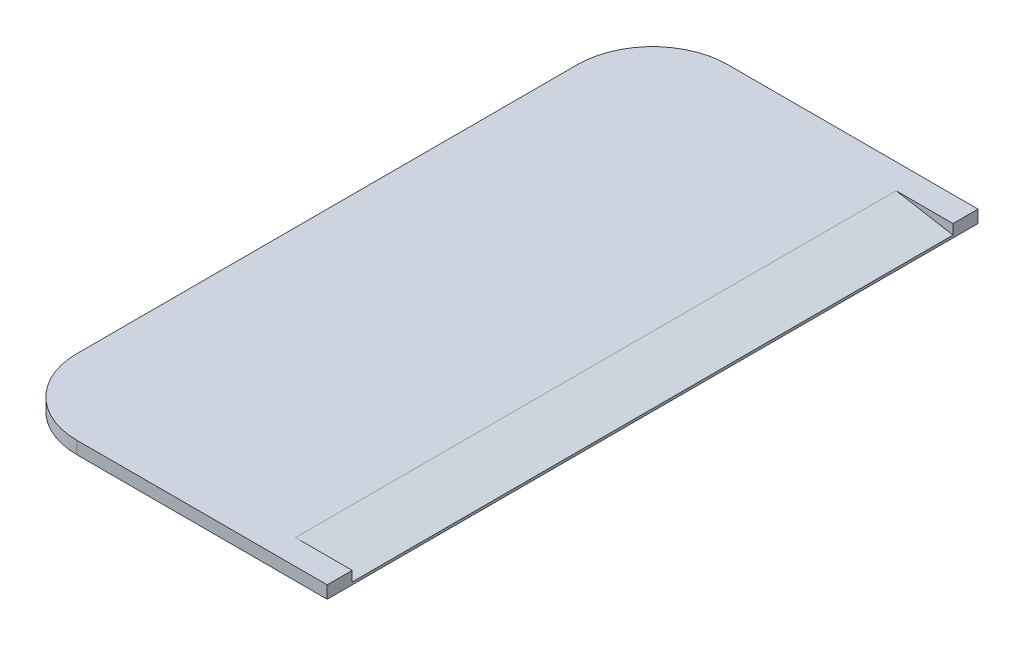
ISO-10303-21;
HEADER;
FILE_DESCRIPTION(('STEP AP214'),'2;1');
FILE_NAME('part.step','',(''),(''),'','','');
FILE_SCHEMA(('AUTOMOTIVE_DESIGN { 1 0 10303 214 1 1 1 1 }'));
ENDSEC;
DATA;
#1=APPLICATION_CONTEXT('core data for automotive mechanical design processes');
#2=APPLICATION_PROTOCOL_DEFINITION('international standard','automotive_design',2000,#1);
#3=PRODUCT_CONTEXT('',#1,'mechanical');
#4=PRODUCT('Part','Part','',(#3));
#5=PRODUCT_RELATED_PRODUCT_CATEGORY('part','',(#4));
#6=PRODUCT_DEFINITION_FORMATION('','',#4);
#7=PRODUCT_DEFINITION_CONTEXT('part definition',#1,'design');
#8=PRODUCT_DEFINITION('design','',#6,#7);
#9=PRODUCT_DEFINITION_SHAPE('','',#8);
#10=(LENGTH_UNIT() NAMED_UNIT(*) SI_UNIT(.MILLI.,.METRE.));
#11=(NAMED_UNIT(*) PLANE_ANGLE_UNIT() SI_UNIT($,.RADIAN.));
#12=(NAMED_UNIT(*) SI_UNIT($,.STERADIAN.) SOLID_ANGLE_UNIT());
#13=UNCERTAINTY_MEASURE_WITH_UNIT(LENGTH_MEASURE(1.E-05),#10,'distance_accuracy_value','');
#14=(GEOMETRIC_REPRESENTATION_CONTEXT(3) GLOBAL_UNCERTAINTY_ASSIGNED_CONTEXT((#13)) GLOBAL_UNIT_ASSIGNED_CONTEXT((#10,
#11,#12)) REPRESENTATION_CONTEXT('',''));
#15=CARTESIAN_POINT('',(0.,0.,0.));
#16=DIRECTION('',(0.,0.,1.));
#17=DIRECTION('',(1.,0.,0.));
#18=AXIS2_PLACEMENT_3D('',#15,#16,#17);
#19=CARTESIAN_POINT('',(13.,0.5,26.));
#20=DIRECTION('',(-1.,0.,0.));
#21=DIRECTION('',(0.,0.,1.));
#22=AXIS2_PLACEMENT_3D('',#19,#20,#21);
#23=PLANE('',#22);
#24=DIRECTION('',(0.,1.,0.));
#25=VECTOR('',#24,1.);
#26=CARTESIAN_POINT('',(13.,0.5,-24.));
#27=LINE('',#26,#25);
#28=CARTESIAN_POINT('',(13.,-0.3,-24.));
#29=VERTEX_POINT('',#28);
#30=CARTESIAN_POINT('',(13.,0.5,-24.));
#31=VERTEX_POINT('',#30);
#32=EDGE_CURVE('E172',#29,#31,#27,.T.);
#33=ORIENTED_EDGE('',*,*,#32,.F.);
#34=DIRECTION('',(0.,0.,1.));
#35=VECTOR('',#34,1.);
#36=CARTESIAN_POINT('',(13.,-0.3,-24.));
#37=LINE('',#36,#35);
#38=CARTESIAN_POINT('',(13.,-0.3,24.));
#39=VERTEX_POINT('',#38);
#40=EDGE_CURVE('E134',#29,#39,#37,.T.);
#41=ORIENTED_EDGE('',*,*,#40,.T.);
#42=DIRECTION('',(0.,1.,0.));
#43=VECTOR('',#42,1.);
#44=CARTESIAN_POINT('',(13.,0.5,24.));
#45=LINE('',#44,#43);
#46=CARTESIAN_POINT('',(13.,0.5,24.));
#47=VERTEX_POINT('',#46);
#48=EDGE_CURVE('E161',#39,#47,#45,.T.);
#49=ORIENTED_EDGE('',*,*,#48,.T.);
#50=DIRECTION('',(0.,0.,-1.));
#51=VECTOR('',#50,1.);
#52=CARTESIAN_POINT('',(13.,0.5,26.));
#53=LINE('',#52,#51);
#54=CARTESIAN_POINT('',(13.,0.5,26.));
#55=VERTEX_POINT('',#54);
#56=EDGE_CURVE('E157',#55,#47,#53,.T.);
#57=ORIENTED_EDGE('',*,*,#56,.F.);
#58=DIRECTION('',(0.,-1.,0.));
#59=VECTOR('',#58,1.);
#60=CARTESIAN_POINT('',(13.,0.5,26.));
#61=LINE('',#60,#59);
#62=CARTESIAN_POINT('',(13.,-0.5,26.));
#63=VERTEX_POINT('',#62);
#64=EDGE_CURVE('E126',#55,#63,#61,.T.);
#65=ORIENTED_EDGE('',*,*,#64,.T.);
#66=DIRECTION('',(0.,0.,-1.));
#67=VECTOR('',#66,1.);
#68=CARTESIAN_POINT('',(13.,-0.5,26.));
#69=LINE('',#68,#67);
#70=CARTESIAN_POINT('',(13.,-0.5,-26.));
#71=VERTEX_POINT('',#70);
#72=EDGE_CURVE('E130',#63,#71,#69,.T.);
#73=ORIENTED_EDGE('',*,*,#72,.T.);
#74=DIRECTION('',(0.,-1.,0.));
#75=VECTOR('',#74,1.);
#76=CARTESIAN_POINT('',(13.,0.5,-26.));
#77=LINE('',#76,#75);
#78=CARTESIAN_POINT('',(13.,0.5,-26.));
#79=VERTEX_POINT('',#78);
#80=EDGE_CURVE('E11',#79,#71,#77,.T.);
#81=ORIENTED_EDGE('',*,*,#80,.F.);
#82=EDGE_CURVE('E91',#31,#79,#53,.T.);
#83=ORIENTED_EDGE('',*,*,#82,.F.);
#84=EDGE_LOOP('',(#33,#41,#49,#57,#65,#73,#81,#83));
#85=FACE_BOUND('',#84,.T.);
#86=ADVANCED_FACE('F33',(#85),#23,.F.);
#87=CARTESIAN_POINT('',(-7.,0.5,-20.));
#88=DIRECTION('',(0.,-1.,0.));
#89=DIRECTION('',(0.,0.,-1.));
#90=AXIS2_PLACEMENT_3D('',#87,#88,#89);
#91=PLANE('',#90);
#92=DIRECTION('',(-1.,0.,0.));
#93=VECTOR('',#92,1.);
#94=CARTESIAN_POINT('',(8.46297454430565,0.5,-24.));
#95=LINE('',#94,#93);
#96=CARTESIAN_POINT('',(8.46297454430565,0.5,-24.));
#97=VERTEX_POINT('',#96);
#98=EDGE_CURVE('E178',#31,#97,#95,.T.);
#99=ORIENTED_EDGE('',*,*,#98,.F.);
#100=ORIENTED_EDGE('',*,*,#82,.T.);
#101=DIRECTION('',(-1.,0.,0.));
#102=VECTOR('',#101,1.);
#103=CARTESIAN_POINT('',(-7.,0.5,-26.));
#104=LINE('',#103,#102);
#105=CARTESIAN_POINT('',(-7.,0.5,-26.));
#106=VERTEX_POINT('',#105);
#107=EDGE_CURVE('E163',#79,#106,#104,.T.);
#108=ORIENTED_EDGE('',*,*,#107,.T.);
#109=CARTESIAN_POINT('',(-7.,0.5,-20.));
#110=DIRECTION('',(0.,1.,0.));
#111=DIRECTION('',(0.,0.,-1.));
#112=AXIS2_PLACEMENT_3D('',#109,#110,#111);
#113=CIRCLE('',#112,6.);
#114=CARTESIAN_POINT('',(-13.,0.5,-20.));
#115=VERTEX_POINT('',#114);
#116=EDGE_CURVE('E109',#106,#115,#113,.T.);
#117=ORIENTED_EDGE('',*,*,#116,.T.);
#118=DIRECTION('',(0.,0.,1.));
#119=VECTOR('',#118,1.);
#120=CARTESIAN_POINT('',(-13.,0.5,20.));
#121=LINE('',#120,#119);
#122=CARTESIAN_POINT('',(-13.,0.5,20.));
#123=VERTEX_POINT('',#122);
#124=EDGE_CURVE('E102',#115,#123,#121,.T.);
#125=ORIENTED_EDGE('',*,*,#124,.T.);
#126=CARTESIAN_POINT('',(-7.,0.5,20.));
#127=DIRECTION('',(0.,1.,0.));
#128=DIRECTION('',(0.,0.,-1.));
#129=AXIS2_PLACEMENT_3D('',#126,#127,#128);
#130=CIRCLE('',#129,6.);
#131=CARTESIAN_POINT('',(-7.,0.5,26.));
#132=VERTEX_POINT('',#131);
#133=EDGE_CURVE('E106',#123,#132,#130,.T.);
#134=ORIENTED_EDGE('',*,*,#133,.T.);
#135=DIRECTION('',(1.,0.,0.));
#136=VECTOR('',#135,1.);
#137=CARTESIAN_POINT('',(-7.,0.5,26.));
#138=LINE('',#137,#136);
#139=EDGE_CURVE('E56',#132,#55,#138,.T.);
#140=ORIENTED_EDGE('',*,*,#139,.T.);
#141=ORIENTED_EDGE('',*,*,#56,.T.);
#142=DIRECTION('',(-1.,0.,0.));
#143=VECTOR('',#142,1.);
#144=CARTESIAN_POINT('',(8.46297454430565,0.5,24.));
#145=LINE('',#144,#143);
#146=CARTESIAN_POINT('',(8.46297454430565,0.5,24.));
#147=VERTEX_POINT('',#146);
#148=EDGE_CURVE('E173',#47,#147,#145,.T.);
#149=ORIENTED_EDGE('',*,*,#148,.T.);
#150=DIRECTION('',(0.,0.,1.));
#151=VECTOR('',#150,1.);
#152=CARTESIAN_POINT('',(8.46297454430565,0.5,-24.));
#153=LINE('',#152,#151);
#154=EDGE_CURVE('E167',#97,#147,#153,.T.);
#155=ORIENTED_EDGE('',*,*,#154,.F.);
#156=EDGE_LOOP('',(#99,#100,#108,#117,#125,#134,#140,#141,#149,#155));
#157=FACE_BOUND('',#156,.T.);
#158=ADVANCED_FACE('F104',(#157),#91,.F.);
#159=CARTESIAN_POINT('',(-7.,0.5,-26.));
#160=DIRECTION('',(0.,0.,1.));
#161=DIRECTION('',(1.,0.,0.));
#162=AXIS2_PLACEMENT_3D('',#159,#160,#161);
#163=PLANE('',#162);
#164=DIRECTION('',(-1.,0.,0.));
#165=VECTOR('',#164,1.);
#166=CARTESIAN_POINT('',(-7.,-0.5,-26.));
#167=LINE('',#166,#165);
#168=CARTESIAN_POINT('',(-7.,-0.5,-26.));
#169=VERTEX_POINT('',#168);
#170=EDGE_CURVE('E133',#71,#169,#167,.T.);
#171=ORIENTED_EDGE('',*,*,#170,.T.);
#172=DIRECTION('',(0.,-1.,0.));
#173=VECTOR('',#172,1.);
#174=CARTESIAN_POINT('',(-7.,0.5,-26.));
#175=LINE('',#174,#173);
#176=EDGE_CURVE('E40',#106,#169,#175,.T.);
#177=ORIENTED_EDGE('',*,*,#176,.F.);
#178=ORIENTED_EDGE('',*,*,#107,.F.);
#179=ORIENTED_EDGE('',*,*,#80,.T.);
#180=EDGE_LOOP('',(#171,#177,#178,#179));
#181=FACE_BOUND('',#180,.T.);
#182=ADVANCED_FACE('F190',(#181),#163,.F.);
#183=CARTESIAN_POINT('',(-7.,0.5,-20.));
#184=DIRECTION('',(0.,-1.,0.));
#185=DIRECTION('',(0.,0.,-1.));
#186=AXIS2_PLACEMENT_3D('',#183,#184,#185);
#187=CYLINDRICAL_SURFACE('',#186,6.);
#188=CARTESIAN_POINT('',(-7.,-0.5,-20.));
#189=DIRECTION('',(0.,1.,0.));
#190=DIRECTION('',(0.,0.,-1.));
#191=AXIS2_PLACEMENT_3D('',#188,#189,#190);
#192=CIRCLE('',#191,6.);
#193=CARTESIAN_POINT('',(-13.,-0.5,-20.));
#194=VERTEX_POINT('',#193);
#195=EDGE_CURVE('E136',#169,#194,#192,.T.);
#196=ORIENTED_EDGE('',*,*,#195,.T.);
#197=DIRECTION('',(0.,-1.,0.));
#198=VECTOR('',#197,1.);
#199=CARTESIAN_POINT('',(-13.,0.5,-20.));
#200=LINE('',#199,#198);
#201=EDGE_CURVE('E121',#115,#194,#200,.T.);
#202=ORIENTED_EDGE('',*,*,#201,.F.);
#203=ORIENTED_EDGE('',*,*,#116,.F.);
#204=ORIENTED_EDGE('',*,*,#176,.T.);
#205=EDGE_LOOP('',(#196,#202,#203,#204));
#206=FACE_BOUND('',#205,.T.);
#207=ADVANCED_FACE('F148',(#206),#187,.T.);
#208=CARTESIAN_POINT('',(-13.,0.5,20.));
#209=DIRECTION('',(1.,0.,0.));
#210=DIRECTION('',(0.,0.,-1.));
#211=AXIS2_PLACEMENT_3D('',#208,#209,#210);
#212=PLANE('',#211);
#213=DIRECTION('',(0.,0.,1.));
#214=VECTOR('',#213,1.);
#215=CARTESIAN_POINT('',(-13.,-0.5,20.));
#216=LINE('',#215,#214);
#217=CARTESIAN_POINT('',(-13.,-0.5,20.));
#218=VERTEX_POINT('',#217);
#219=EDGE_CURVE('E118',#194,#218,#216,.T.);
#220=ORIENTED_EDGE('',*,*,#219,.T.);
#221=DIRECTION('',(0.,-1.,0.));
#222=VECTOR('',#221,1.);
#223=CARTESIAN_POINT('',(-13.,0.5,20.));
#224=LINE('',#223,#222);
#225=EDGE_CURVE('E115',#123,#218,#224,.T.);
#226=ORIENTED_EDGE('',*,*,#225,.F.);
#227=ORIENTED_EDGE('',*,*,#124,.F.);
#228=ORIENTED_EDGE('',*,*,#201,.T.);
#229=EDGE_LOOP('',(#220,#226,#227,#228));
#230=FACE_BOUND('',#229,.T.);
#231=ADVANCED_FACE('F116',(#230),#212,.F.);
#232=CARTESIAN_POINT('',(-7.,0.5,20.));
#233=DIRECTION('',(0.,-1.,0.));
#234=DIRECTION('',(0.,0.,-1.));
#235=AXIS2_PLACEMENT_3D('',#232,#233,#234);
#236=CYLINDRICAL_SURFACE('',#235,6.);
#237=CARTESIAN_POINT('',(-7.,-0.5,20.));
#238=DIRECTION('',(0.,1.,0.));
#239=DIRECTION('',(0.,0.,-1.));
#240=AXIS2_PLACEMENT_3D('',#237,#238,#239);
#241=CIRCLE('',#240,6.);
#242=CARTESIAN_POINT('',(-7.,-0.5,26.));
#243=VERTEX_POINT('',#242);
#244=EDGE_CURVE('E139',#218,#243,#241,.T.);
#245=ORIENTED_EDGE('',*,*,#244,.T.);
#246=DIRECTION('',(0.,-1.,0.));
#247=VECTOR('',#246,1.);
#248=CARTESIAN_POINT('',(-7.,0.5,26.));
#249=LINE('',#248,#247);
#250=EDGE_CURVE('E122',#132,#243,#249,.T.);
#251=ORIENTED_EDGE('',*,*,#250,.F.);
#252=ORIENTED_EDGE('',*,*,#133,.F.);
#253=ORIENTED_EDGE('',*,*,#225,.T.);
#254=EDGE_LOOP('',(#245,#251,#252,#253));
#255=FACE_BOUND('',#254,.T.);
#256=ADVANCED_FACE('F124',(#255),#236,.T.);
#257=CARTESIAN_POINT('',(-7.,0.5,26.));
#258=DIRECTION('',(0.,0.,-1.));
#259=DIRECTION('',(-1.,0.,0.));
#260=AXIS2_PLACEMENT_3D('',#257,#258,#259);
#261=PLANE('',#260);
#262=DIRECTION('',(1.,0.,0.));
#263=VECTOR('',#262,1.);
#264=CARTESIAN_POINT('',(-7.,-0.5,26.));
#265=LINE('',#264,#263);
#266=EDGE_CURVE('E83',#243,#63,#265,.T.);
#267=ORIENTED_EDGE('',*,*,#266,.T.);
#268=ORIENTED_EDGE('',*,*,#64,.F.);
#269=ORIENTED_EDGE('',*,*,#139,.F.);
#270=ORIENTED_EDGE('',*,*,#250,.T.);
#271=EDGE_LOOP('',(#267,#268,#269,#270));
#272=FACE_BOUND('',#271,.T.);
#273=ADVANCED_FACE('F153',(#272),#261,.F.);
#274=CARTESIAN_POINT('',(-7.,-0.5,-20.));
#275=DIRECTION('',(0.,-1.,0.));
#276=DIRECTION('',(0.,0.,-1.));
#277=AXIS2_PLACEMENT_3D('',#274,#275,#276);
#278=PLANE('',#277);
#279=ORIENTED_EDGE('',*,*,#72,.F.);
#280=ORIENTED_EDGE('',*,*,#266,.F.);
#281=ORIENTED_EDGE('',*,*,#244,.F.);
#282=ORIENTED_EDGE('',*,*,#219,.F.);
#283=ORIENTED_EDGE('',*,*,#195,.F.);
#284=ORIENTED_EDGE('',*,*,#170,.F.);
#285=EDGE_LOOP('',(#279,#280,#281,#282,#283,#284));
#286=FACE_BOUND('',#285,.T.);
#287=ADVANCED_FACE('F152',(#286),#278,.T.);
#288=CARTESIAN_POINT('',(13.,-0.3,-24.));
#289=DIRECTION('',(-0.173648177666923,-0.984807753012209,0.));
#290=DIRECTION('',(0.984807753012209,-0.173648177666923,0.));
#291=AXIS2_PLACEMENT_3D('',#288,#289,#290);
#292=PLANE('',#291);
#293=DIRECTION('',(0.984807753012209,-0.173648177666923,0.));
#294=VECTOR('',#293,1.);
#295=CARTESIAN_POINT('',(13.,-0.3,24.));
#296=LINE('',#295,#294);
#297=EDGE_CURVE('E47',#147,#39,#296,.T.);
#298=ORIENTED_EDGE('',*,*,#297,.T.);
#299=ORIENTED_EDGE('',*,*,#40,.F.);
#300=DIRECTION('',(0.984807753012209,-0.173648177666923,0.));
#301=VECTOR('',#300,1.);
#302=CARTESIAN_POINT('',(13.,-0.3,-24.));
#303=LINE('',#302,#301);
#304=EDGE_CURVE('E169',#97,#29,#303,.T.);
#305=ORIENTED_EDGE('',*,*,#304,.F.);
#306=ORIENTED_EDGE('',*,*,#154,.T.);
#307=EDGE_LOOP('',(#298,#299,#305,#306));
#308=FACE_BOUND('',#307,.T.);
#309=ADVANCED_FACE('F212',(#308),#292,.F.);
#310=CARTESIAN_POINT('',(0.,0.,-24.));
#311=DIRECTION('',(0.,0.,1.));
#312=DIRECTION('',(1.,0.,0.));
#313=AXIS2_PLACEMENT_3D('',#310,#311,#312);
#314=PLANE('',#313);
#315=ORIENTED_EDGE('',*,*,#32,.T.);
#316=ORIENTED_EDGE('',*,*,#98,.T.);
#317=ORIENTED_EDGE('',*,*,#304,.T.);
#318=EDGE_LOOP('',(#315,#316,#317));
#319=FACE_BOUND('',#318,.T.);
#320=ADVANCED_FACE('F184',(#319),#314,.T.);
#321=CARTESIAN_POINT('',(0.,0.,24.));
#322=DIRECTION('',(0.,0.,1.));
#323=DIRECTION('',(1.,0.,0.));
#324=AXIS2_PLACEMENT_3D('',#321,#322,#323);
#325=PLANE('',#324);
#326=ORIENTED_EDGE('',*,*,#48,.F.);
#327=ORIENTED_EDGE('',*,*,#297,.F.);
#328=ORIENTED_EDGE('',*,*,#148,.F.);
#329=EDGE_LOOP('',(#326,#327,#328));
#330=FACE_BOUND('',#329,.T.);
#331=ADVANCED_FACE('F227',(#330),#325,.F.);
#332=CLOSED_SHELL('',(#86,#158,#182,#207,#231,#256,#273,#287,#309,#320,#331));
#333=MANIFOLD_SOLID_BREP('B2',#332);
#334=ADVANCED_BREP_SHAPE_REPRESENTATION('',(#18,#333),#14);
#335=SHAPE_DEFINITION_REPRESENTATION(#9,#334);
ENDSEC;
END-ISO-10303-21;
